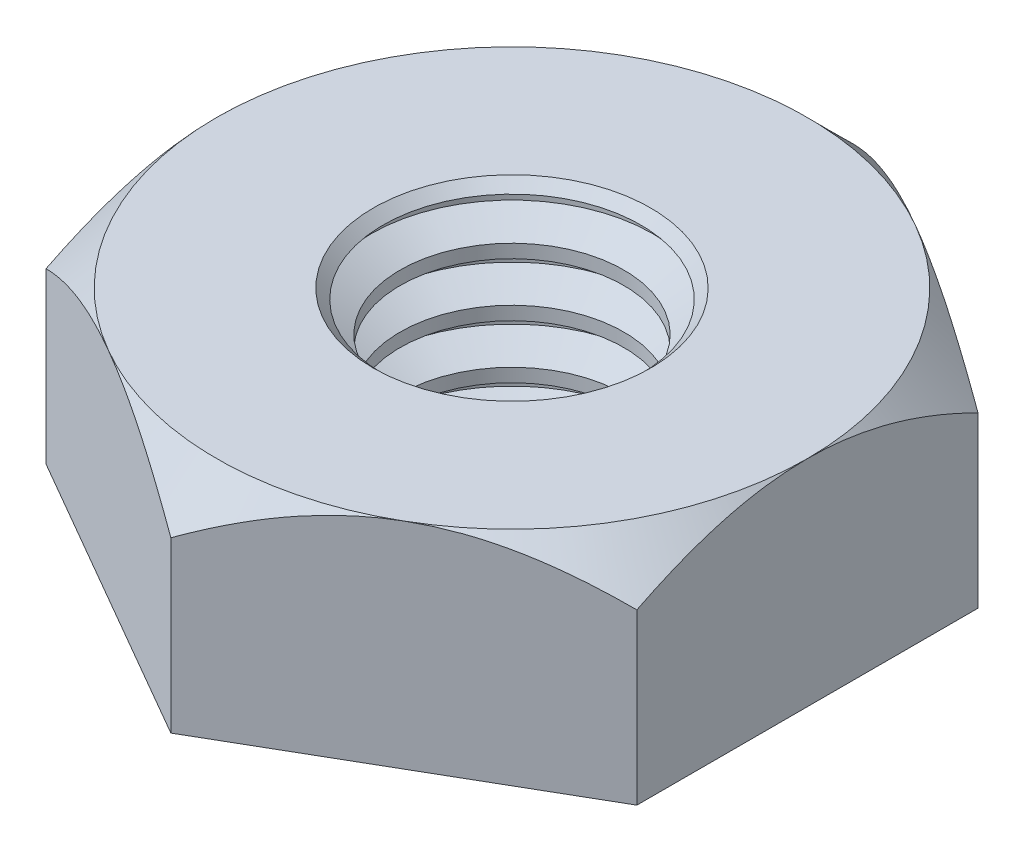
ISO-10303-21;
HEADER;
FILE_DESCRIPTION(('STEP AP214'),'2;1');
FILE_NAME('part.step','',(''),(''),'','','');
FILE_SCHEMA(('AUTOMOTIVE_DESIGN { 1 0 10303 214 1 1 1 1 }'));
ENDSEC;
DATA;
#1=APPLICATION_CONTEXT('core data for automotive mechanical design processes');
#2=APPLICATION_PROTOCOL_DEFINITION('international standard','automotive_design',2000,#1);
#3=PRODUCT_CONTEXT('',#1,'mechanical');
#4=PRODUCT('Part','Part','',(#3));
#5=PRODUCT_RELATED_PRODUCT_CATEGORY('part','',(#4));
#6=PRODUCT_DEFINITION_FORMATION('','',#4);
#7=PRODUCT_DEFINITION_CONTEXT('part definition',#1,'design');
#8=PRODUCT_DEFINITION('design','',#6,#7);
#9=PRODUCT_DEFINITION_SHAPE('','',#8);
#10=(LENGTH_UNIT() NAMED_UNIT(*) SI_UNIT(.MILLI.,.METRE.));
#11=(NAMED_UNIT(*) PLANE_ANGLE_UNIT() SI_UNIT($,.RADIAN.));
#12=(NAMED_UNIT(*) SI_UNIT($,.STERADIAN.) SOLID_ANGLE_UNIT());
#13=UNCERTAINTY_MEASURE_WITH_UNIT(LENGTH_MEASURE(1.E-05),#10,'distance_accuracy_value','');
#14=(GEOMETRIC_REPRESENTATION_CONTEXT(3) GLOBAL_UNCERTAINTY_ASSIGNED_CONTEXT((#13)) GLOBAL_UNIT_ASSIGNED_CONTEXT((#10,
#11,#12)) REPRESENTATION_CONTEXT('',''));
#15=CARTESIAN_POINT('',(0.,0.,0.));
#16=DIRECTION('',(0.,0.,1.));
#17=DIRECTION('',(1.,0.,0.));
#18=AXIS2_PLACEMENT_3D('',#15,#16,#17);
#19=CARTESIAN_POINT('',(0.,0.,-5.04098953786192));
#20=DIRECTION('',(0.,1.,0.));
#21=DIRECTION('',(0.,0.,1.));
#22=AXIS2_PLACEMENT_3D('',#19,#20,#21);
#23=PLANE('',#22);
#24=DIRECTION('',(-0.866025403784439,0.,-0.5));
#25=VECTOR('',#24,1.);
#26=CARTESIAN_POINT('',(4.365625,0.,-2.52049476893096));
#27=LINE('',#26,#25);
#28=CARTESIAN_POINT('',(4.365625,0.,-2.52049476893096));
#29=VERTEX_POINT('',#28);
#30=CARTESIAN_POINT('',(0.,0.,-5.04098953786192));
#31=VERTEX_POINT('',#30);
#32=EDGE_CURVE('E262',#29,#31,#27,.T.);
#33=ORIENTED_EDGE('',*,*,#32,.F.);
#34=DIRECTION('',(0.,0.,-1.));
#35=VECTOR('',#34,1.);
#36=CARTESIAN_POINT('',(4.365625,0.,2.52049476893096));
#37=LINE('',#36,#35);
#38=CARTESIAN_POINT('',(4.365625,0.,2.52049476893096));
#39=VERTEX_POINT('',#38);
#40=EDGE_CURVE('E269',#39,#29,#37,.T.);
#41=ORIENTED_EDGE('',*,*,#40,.F.);
#42=DIRECTION('',(0.866025403784439,0.,-0.5));
#43=VECTOR('',#42,1.);
#44=CARTESIAN_POINT('',(0.,0.,5.04098953786192));
#45=LINE('',#44,#43);
#46=CARTESIAN_POINT('',(0.,0.,5.04098953786192));
#47=VERTEX_POINT('',#46);
#48=EDGE_CURVE('E265',#47,#39,#45,.T.);
#49=ORIENTED_EDGE('',*,*,#48,.F.);
#50=DIRECTION('',(0.866025403784439,0.,0.5));
#51=VECTOR('',#50,1.);
#52=CARTESIAN_POINT('',(-4.365625,0.,2.52049476893096));
#53=LINE('',#52,#51);
#54=CARTESIAN_POINT('',(-4.365625,0.,2.52049476893096));
#55=VERTEX_POINT('',#54);
#56=EDGE_CURVE('E128',#55,#47,#53,.T.);
#57=ORIENTED_EDGE('',*,*,#56,.F.);
#58=DIRECTION('',(0.,0.,1.));
#59=VECTOR('',#58,1.);
#60=CARTESIAN_POINT('',(-4.365625,0.,-2.52049476893096));
#61=LINE('',#60,#59);
#62=CARTESIAN_POINT('',(-4.365625,0.,-2.52049476893096));
#63=VERTEX_POINT('',#62);
#64=EDGE_CURVE('E261',#63,#55,#61,.T.);
#65=ORIENTED_EDGE('',*,*,#64,.F.);
#66=DIRECTION('',(-0.866025403784439,0.,0.5));
#67=VECTOR('',#66,1.);
#68=CARTESIAN_POINT('',(0.,0.,-5.04098953786192));
#69=LINE('',#68,#67);
#70=EDGE_CURVE('E257',#31,#63,#69,.T.);
#71=ORIENTED_EDGE('',*,*,#70,.F.);
#72=EDGE_LOOP('',(#33,#41,#49,#57,#65,#71));
#73=FACE_BOUND('',#72,.T.);
#74=CARTESIAN_POINT('',(0.,0.,0.));
#75=DIRECTION('',(0.,1.,0.));
#76=DIRECTION('',(0.,0.,1.));
#77=AXIS2_PLACEMENT_3D('',#74,#75,#76);
#78=CIRCLE('',#77,1.65317020984131);
#79=CARTESIAN_POINT('',(0.,0.,1.65317020984131));
#80=VERTEX_POINT('',#79);
#81=EDGE_CURVE('E340',#80,#80,#78,.T.);
#82=ORIENTED_EDGE('',*,*,#81,.T.);
#83=EDGE_LOOP('',(#82));
#84=FACE_BOUND('',#83,.T.);
#85=ADVANCED_FACE('F35',(#73,#84),#23,.F.);
#86=CARTESIAN_POINT('',(0.,3.175,-5.04098953786192));
#87=DIRECTION('',(0.,1.,0.));
#88=DIRECTION('',(0.,0.,1.));
#89=AXIS2_PLACEMENT_3D('',#86,#87,#88);
#90=PLANE('',#89);
#91=CARTESIAN_POINT('',(0.,3.175,0.));
#92=DIRECTION('',(0.,1.,0.));
#93=DIRECTION('',(0.,0.,1.));
#94=AXIS2_PLACEMENT_3D('',#91,#92,#93);
#95=CIRCLE('',#94,2.05004520984131);
#96=CARTESIAN_POINT('',(0.,3.175,2.05004520984131));
#97=VERTEX_POINT('',#96);
#98=EDGE_CURVE('E12',#97,#97,#95,.F.);
#99=ORIENTED_EDGE('',*,*,#98,.T.);
#100=EDGE_LOOP('',(#99));
#101=FACE_BOUND('',#100,.T.);
#102=CARTESIAN_POINT('',(0.,3.175,0.));
#103=DIRECTION('',(0.,1.,0.));
#104=DIRECTION('',(0.,0.,1.));
#105=AXIS2_PLACEMENT_3D('',#102,#103,#104);
#106=CIRCLE('',#105,4.365625);
#107=CARTESIAN_POINT('',(-2.1828125,3.175,3.78074215339644));
#108=VERTEX_POINT('',#107);
#109=CARTESIAN_POINT('',(2.1828125,3.175,3.78074215339644));
#110=VERTEX_POINT('',#109);
#111=EDGE_CURVE('E110',#108,#110,#106,.T.);
#112=ORIENTED_EDGE('',*,*,#111,.T.);
#113=CARTESIAN_POINT('',(0.,3.175,0.));
#114=DIRECTION('',(0.,1.,0.));
#115=DIRECTION('',(0.,0.,1.));
#116=AXIS2_PLACEMENT_3D('',#113,#114,#115);
#117=CIRCLE('',#116,4.365625);
#118=CARTESIAN_POINT('',(4.365625,3.175,0.));
#119=VERTEX_POINT('',#118);
#120=EDGE_CURVE('E50',#110,#119,#117,.T.);
#121=ORIENTED_EDGE('',*,*,#120,.T.);
#122=CARTESIAN_POINT('',(2.1828125,3.175,-3.78074215339644));
#123=VERTEX_POINT('',#122);
#124=EDGE_CURVE('E143',#119,#123,#106,.T.);
#125=ORIENTED_EDGE('',*,*,#124,.T.);
#126=CARTESIAN_POINT('',(-2.1828125,3.175,-3.78074215339644));
#127=VERTEX_POINT('',#126);
#128=EDGE_CURVE('E147',#123,#127,#106,.T.);
#129=ORIENTED_EDGE('',*,*,#128,.T.);
#130=CARTESIAN_POINT('',(-4.365625,3.175,0.));
#131=VERTEX_POINT('',#130);
#132=EDGE_CURVE('E150',#127,#131,#106,.T.);
#133=ORIENTED_EDGE('',*,*,#132,.T.);
#134=EDGE_CURVE('E142',#131,#108,#106,.T.);
#135=ORIENTED_EDGE('',*,*,#134,.T.);
#136=EDGE_LOOP('',(#112,#121,#125,#129,#133,#135));
#137=FACE_BOUND('',#136,.T.);
#138=ADVANCED_FACE('F157',(#101,#137),#90,.T.);
#139=CARTESIAN_POINT('',(4.365625,3.175,-2.52049476893096));
#140=DIRECTION('',(-0.5,0.,0.866025403784439));
#141=DIRECTION('',(0.866025403784439,0.,0.5));
#142=AXIS2_PLACEMENT_3D('',#139,#140,#141);
#143=PLANE('',#142);
#144=CARTESIAN_POINT('',(4.365825,2.49951998811687,-2.52037929887713));
#145=CARTESIAN_POINT('',(4.29075926179721,2.5428556843937,-2.56371852303542));
#146=CARTESIAN_POINT('',(4.21511652405691,2.58486150694082,-2.60739087803202));
#147=CARTESIAN_POINT('',(4.06256384257887,2.66580884918542,-2.69546720974897));
#148=CARTESIAN_POINT('',(3.98565323405556,2.70474869521597,-2.73987157028344));
#149=CARTESIAN_POINT('',(3.75213521872552,2.81669452590529,-2.87469325929487));
#150=CARTESIAN_POINT('',(3.59355091897805,2.88434920314825,-2.96625194744332));
#151=CARTESIAN_POINT('',(3.27375295789606,3.00020333018922,-3.1508873863603));
#152=CARTESIAN_POINT('',(3.11262104210945,3.04869466909121,-3.24391694131474));
#153=CARTESIAN_POINT('',(2.86827398509099,3.1047873481826,-3.38499078046004));
#154=CARTESIAN_POINT('',(2.78646520845363,3.12070335091413,-3.43222309967369));
#155=CARTESIAN_POINT('',(2.62215493673047,3.14662706744581,-3.52708767928368));
#156=CARTESIAN_POINT('',(2.53965354705096,3.15663566431487,-3.57471987882366));
#157=CARTESIAN_POINT('',(2.33861197089847,3.17341632845891,-3.69079128693361));
#158=CARTESIAN_POINT('',(2.21985517581475,3.17693743451113,-3.7593555545433));
#159=CARTESIAN_POINT('',(1.9825555950651,3.17102881515628,-3.89636053136769));
#160=CARTESIAN_POINT('',(1.8640128990038,3.16159454983167,-3.96480118884914));
#161=CARTESIAN_POINT('',(1.62804507322986,3.13033130179081,-4.10103727657982));
#162=CARTESIAN_POINT('',(1.51062134300582,3.10848845674929,-4.16883189883392));
#163=CARTESIAN_POINT('',(1.27779209770266,3.05359557133502,-4.30325592628492));
#164=CARTESIAN_POINT('',(1.16238642859219,3.02054639026254,-4.36988542041185));
#165=CARTESIAN_POINT('',(0.957514998599648,2.95255207631629,-4.48816799566731));
#166=CARTESIAN_POINT('',(0.867595701157639,2.91939475932441,-4.5400829262508));
#167=CARTESIAN_POINT('',(0.689371364291638,2.84773661607479,-4.64298079511653));
#168=CARTESIAN_POINT('',(0.601066374030605,2.80923562738386,-4.69396370501452));
#169=CARTESIAN_POINT('',(0.42634877155884,2.72775327359755,-4.79483695983376));
#170=CARTESIAN_POINT('',(0.339931190163336,2.68478599766642,-4.84473017371517));
#171=CARTESIAN_POINT('',(0.168696346553443,2.59493525616829,-4.94359265676799));
#172=CARTESIAN_POINT('',(0.0838781412149917,2.54805419303698,-4.99256247045232));
#173=CARTESIAN_POINT('',(-0.000200000000001605,2.49951998811686,-5.04110500791576));
#174=B_SPLINE_CURVE_WITH_KNOTS('',3,(#144,#145,#146,#147,#148,#149,#150,#151,#152,#153,#154,
#155,#156,#157,#158,#159,#160,#161,#162,#163,#164,#165,#166,#167,#168,#169,#170,#171,#172,#173),
.UNSPECIFIED.,.F.,.F.,(4,2,2,2,2,2,2,2,2,2,2,2,2,2,4),(0.,0.290706610356815,0.581570828097977,
1.16643976138302,1.74202094661304,2.02924700568145,2.31643011786515,2.72731191561999,
3.13833773437735,3.54982363883689,3.96127799774813,4.28811145534738,4.61495484997813,
4.94079680753749,5.26644020086356),.UNSPECIFIED.);
#175=CARTESIAN_POINT('',(4.365625,2.49963546213808,-2.52049476893097));
#176=VERTEX_POINT('',#175);
#177=EDGE_CURVE('E272',#176,#123,#174,.T.);
#178=ORIENTED_EDGE('',*,*,#177,.F.);
#179=DIRECTION('',(0.,-1.,0.));
#180=VECTOR('',#179,1.);
#181=CARTESIAN_POINT('',(4.365625,3.175,-2.52049476893096));
#182=LINE('',#181,#180);
#183=EDGE_CURVE('E135',#176,#29,#182,.T.);
#184=ORIENTED_EDGE('',*,*,#183,.T.);
#185=ORIENTED_EDGE('',*,*,#32,.T.);
#186=DIRECTION('',(0.,-1.,0.));
#187=VECTOR('',#186,1.);
#188=CARTESIAN_POINT('',(0.,3.175,-5.04098953786192));
#189=LINE('',#188,#187);
#190=CARTESIAN_POINT('',(0.,2.49963546213808,-5.04098953786192));
#191=VERTEX_POINT('',#190);
#192=EDGE_CURVE('E140',#191,#31,#189,.T.);
#193=ORIENTED_EDGE('',*,*,#192,.F.);
#194=EDGE_CURVE('E209',#123,#191,#174,.T.);
#195=ORIENTED_EDGE('',*,*,#194,.F.);
#196=EDGE_LOOP('',(#178,#184,#185,#193,#195));
#197=FACE_BOUND('',#196,.T.);
#198=ADVANCED_FACE('F218',(#197),#143,.F.);
#199=CARTESIAN_POINT('',(0.,3.175,-5.04098953786192));
#200=DIRECTION('',(0.5,0.,0.866025403784439));
#201=DIRECTION('',(0.866025403784439,0.,-0.5));
#202=AXIS2_PLACEMENT_3D('',#199,#200,#201);
#203=PLANE('',#202);
#204=CARTESIAN_POINT('',(0.000199999999998374,2.49951998811686,-5.04110500791576));
#205=CARTESIAN_POINT('',(-0.0748657382027902,2.54285568439369,-4.99776578375746));
#206=CARTESIAN_POINT('',(-0.150508475943085,2.58486150694081,-4.95409342876086));
#207=CARTESIAN_POINT('',(-0.30306115742113,2.66580884918542,-4.86601709704392));
#208=CARTESIAN_POINT('',(-0.379971765944441,2.70474869521597,-4.82161273650944));
#209=CARTESIAN_POINT('',(-0.613489781274479,2.81669452590529,-4.68679104749802));
#210=CARTESIAN_POINT('',(-0.772074081021948,2.88434920314825,-4.59523235934957));
#211=CARTESIAN_POINT('',(-1.09187204210394,3.00020333018922,-4.41059692043259));
#212=CARTESIAN_POINT('',(-1.25300395789055,3.0486946690912,-4.31756736547815));
#213=CARTESIAN_POINT('',(-1.49735101490901,3.1047873481826,-4.17649352633285));
#214=CARTESIAN_POINT('',(-1.57915979154637,3.12070335091412,-4.1292612071192));
#215=CARTESIAN_POINT('',(-1.74347006326953,3.14662706744581,-4.03439662750921));
#216=CARTESIAN_POINT('',(-1.82597145294904,3.15663566431487,-3.98676442796922));
#217=CARTESIAN_POINT('',(-2.02701302910153,3.17341632845891,-3.87069301985927));
#218=CARTESIAN_POINT('',(-2.14576982418526,3.17693743451113,-3.80212875224959));
#219=CARTESIAN_POINT('',(-2.3830694049349,3.17102881515628,-3.6651237754252));
#220=CARTESIAN_POINT('',(-2.5016121009962,3.16159454983167,-3.59668311794374));
#221=CARTESIAN_POINT('',(-2.73757992677014,3.13033130179081,-3.46044703021306));
#222=CARTESIAN_POINT('',(-2.85500365699418,3.10848845674929,-3.39265240795897));
#223=CARTESIAN_POINT('',(-3.08783290229734,3.05359557133502,-3.25822838050797));
#224=CARTESIAN_POINT('',(-3.20323857140781,3.02054639026254,-3.19159888638103));
#225=CARTESIAN_POINT('',(-3.40811000140035,2.95255207631629,-3.07331631112557));
#226=CARTESIAN_POINT('',(-3.49802929884236,2.91939475932441,-3.02140138054209));
#227=CARTESIAN_POINT('',(-3.67625363570836,2.84773661607479,-2.91850351167636));
#228=CARTESIAN_POINT('',(-3.7645586259694,2.80923562738386,-2.86752060177837));
#229=CARTESIAN_POINT('',(-3.93927622844116,2.72775327359755,-2.76664734695913));
#230=CARTESIAN_POINT('',(-4.02569380983666,2.68478599766642,-2.71675413307772));
#231=CARTESIAN_POINT('',(-4.19692865344656,2.59493525616829,-2.6178916500249));
#232=CARTESIAN_POINT('',(-4.28174685878501,2.54805419303698,-2.56892183634056));
#233=CARTESIAN_POINT('',(-4.365825,2.49951998811686,-2.52037929887712));
#234=B_SPLINE_CURVE_WITH_KNOTS('',3,(#204,#205,#206,#207,#208,#209,#210,#211,#212,#213,#214,
#215,#216,#217,#218,#219,#220,#221,#222,#223,#224,#225,#226,#227,#228,#229,#230,#231,#232,#233),
.UNSPECIFIED.,.F.,.F.,(4,2,2,2,2,2,2,2,2,2,2,2,2,2,4),(0.,0.290706610356816,0.581570828097979,
1.16643976138302,1.74202094661305,2.02924700568145,2.31643011786515,2.72731191561999,
3.13833773437736,3.54982363883689,3.96127799774814,4.28811145534738,4.61495484997813,
4.94079680753749,5.26644020086356),.UNSPECIFIED.);
#235=EDGE_CURVE('E208',#191,#127,#234,.T.);
#236=ORIENTED_EDGE('',*,*,#235,.F.);
#237=ORIENTED_EDGE('',*,*,#192,.T.);
#238=ORIENTED_EDGE('',*,*,#70,.T.);
#239=DIRECTION('',(0.,-1.,0.));
#240=VECTOR('',#239,1.);
#241=CARTESIAN_POINT('',(-4.365625,3.175,-2.52049476893096));
#242=LINE('',#241,#240);
#243=CARTESIAN_POINT('',(-4.365625,2.49963546213808,-2.52049476893097));
#244=VERTEX_POINT('',#243);
#245=EDGE_CURVE('E133',#244,#63,#242,.T.);
#246=ORIENTED_EDGE('',*,*,#245,.F.);
#247=EDGE_CURVE('E203',#127,#244,#234,.T.);
#248=ORIENTED_EDGE('',*,*,#247,.F.);
#249=EDGE_LOOP('',(#236,#237,#238,#246,#248));
#250=FACE_BOUND('',#249,.T.);
#251=ADVANCED_FACE('F214',(#250),#203,.F.);
#252=CARTESIAN_POINT('',(-4.365625,3.175,-2.52049476893096));
#253=DIRECTION('',(1.,0.,0.));
#254=DIRECTION('',(0.,0.,-1.));
#255=AXIS2_PLACEMENT_3D('',#252,#253,#254);
#256=PLANE('',#255);
#257=CARTESIAN_POINT('',(-4.365625,0.704912579661346,-5.26006489056433));
#258=CARTESIAN_POINT('',(-4.365625,0.80267892983793,-5.1329841859818));
#259=CARTESIAN_POINT('',(-4.365625,0.899569220714148,-5.00521874689069));
#260=CARTESIAN_POINT('',(-4.365625,1.09119744425269,-4.7480385262146));
#261=CARTESIAN_POINT('',(-4.365625,1.18593486227081,-4.6186233615674));
#262=CARTESIAN_POINT('',(-4.365625,1.37353129405869,-4.35691808766542));
#263=CARTESIAN_POINT('',(-4.365625,1.46637017769497,-4.22461350133101));
#264=CARTESIAN_POINT('',(-4.365625,1.64881712700763,-3.95780239294876));
#265=CARTESIAN_POINT('',(-4.365625,1.73842541514534,-3.82329602344843));
#266=CARTESIAN_POINT('',(-4.365625,1.91923152416555,-3.54310038592311));
#267=CARTESIAN_POINT('',(-4.365625,2.0101698538518,-3.39724282764264));
#268=CARTESIAN_POINT('',(-4.365625,2.18640211336186,-3.10210247150436));
#269=CARTESIAN_POINT('',(-4.365625,2.27169509328475,-2.95281910287325));
#270=CARTESIAN_POINT('',(-4.365625,2.43482022055583,-2.65078628816501));
#271=CARTESIAN_POINT('',(-4.365625,2.51267426921964,-2.49804876401671));
#272=CARTESIAN_POINT('',(-4.365625,2.65917723070185,-2.18825597231203));
#273=CARTESIAN_POINT('',(-4.365625,2.72783048599296,-2.03120278408456));
#274=CARTESIAN_POINT('',(-4.365625,2.84724495878238,-1.72816423864564));
#275=CARTESIAN_POINT('',(-4.365625,2.89910313311,-1.5826155847136));
#276=CARTESIAN_POINT('',(-4.365625,2.99116920619303,-1.2878101350948));
#277=CARTESIAN_POINT('',(-4.365625,3.03137636289258,-1.1385531038777));
#278=CARTESIAN_POINT('',(-4.365625,3.09729383406965,-0.83982185436757));
#279=CARTESIAN_POINT('',(-4.365625,3.12326744800821,-0.690406728134636));
#280=CARTESIAN_POINT('',(-4.365625,3.16017597579481,-0.389720117691568));
#281=CARTESIAN_POINT('',(-4.365625,3.17111400974627,-0.238449025197239));
#282=CARTESIAN_POINT('',(-4.365625,3.1770196548063,0.0577907271338069));
#283=CARTESIAN_POINT('',(-4.365625,3.17266407223423,0.202746020460245));
#284=CARTESIAN_POINT('',(-4.365625,3.14977668074263,0.491525443469046));
#285=CARTESIAN_POINT('',(-4.365625,3.13124358417651,0.635349469207359));
#286=CARTESIAN_POINT('',(-4.365625,3.08073406930188,0.923262931460914));
#287=CARTESIAN_POINT('',(-4.365625,3.04852030695866,1.0673100183025));
#288=CARTESIAN_POINT('',(-4.365625,2.97243663849279,1.35223202145247));
#289=CARTESIAN_POINT('',(-4.365625,2.92856739438755,1.49310711743332));
#290=CARTESIAN_POINT('',(-4.365625,2.82829132796462,1.77944606428932));
#291=CARTESIAN_POINT('',(-4.365625,2.77130692063028,1.92470532838635));
#292=CARTESIAN_POINT('',(-4.365625,2.64853439221219,2.21148751875443));
#293=CARTESIAN_POINT('',(-4.365625,2.58274230151922,2.35300872565198));
#294=CARTESIAN_POINT('',(-4.365625,2.44391465170222,2.63298314411336));
#295=CARTESIAN_POINT('',(-4.365625,2.37085678258171,2.77142520257403));
#296=CARTESIAN_POINT('',(-4.365625,2.219105296034,3.04513698555421));
#297=CARTESIAN_POINT('',(-4.365625,2.14041254634271,3.18040719427782));
#298=CARTESIAN_POINT('',(-4.365625,1.98248926861825,3.44157865405833));
#299=CARTESIAN_POINT('',(-4.365625,1.9034771910414,3.56761269781683));
#300=CARTESIAN_POINT('',(-4.365625,1.74208988391647,3.81751542571875));
#301=CARTESIAN_POINT('',(-4.365625,1.65971440221839,3.9413839465179));
#302=CARTESIAN_POINT('',(-4.365625,1.4928706732036,4.18624305036429));
#303=CARTESIAN_POINT('',(-4.365625,1.40842453863359,4.30724875510755));
#304=CARTESIAN_POINT('',(-4.365625,1.23726856590243,4.54760013073487));
#305=CARTESIAN_POINT('',(-4.365625,1.1505593581824,4.66694625003688));
#306=CARTESIAN_POINT('',(-4.365625,1.06292381609541,4.78559619977847));
#307=B_SPLINE_CURVE_WITH_KNOTS('',3,(#257,#258,#259,#260,#261,#262,#263,#264,#265,#266,#267,
#268,#269,#270,#271,#272,#273,#274,#275,#276,#277,#278,#279,#280,#281,#282,#283,#284,#285,#286,
#287,#288,#289,#290,#291,#292,#293,#294,#295,#296,#297,#298,#299,#300,#301,#302,#303,#304,#305,
#306),.UNSPECIFIED.,.F.,.F.,(4,2,2,2,2,2,2,2,2,2,2,2,2,2,2,2,2,2,2,2,2,2,2,2,4),(0.,
0.481018057807076,0.962149918440635,1.44699361883673,1.93180386850032,2.44735513975326,
2.96299293959461,3.47706255965263,3.99088869478828,4.4540225010778,4.91718579798021,
5.37146415229228,5.82564822294318,6.25999088997209,6.69437301005721,7.13662055973024,
7.57884299564045,8.04659469469021,8.51455792293897,8.98400523488901,9.45338040975317,
9.89957717259381,10.3458074478608,10.7884549913015,11.2309805122862),.UNSPECIFIED.);
#308=EDGE_CURVE('E162',#244,#131,#307,.T.);
#309=ORIENTED_EDGE('',*,*,#308,.F.);
#310=ORIENTED_EDGE('',*,*,#245,.T.);
#311=ORIENTED_EDGE('',*,*,#64,.T.);
#312=DIRECTION('',(0.,-1.,0.));
#313=VECTOR('',#312,1.);
#314=CARTESIAN_POINT('',(-4.365625,3.175,2.52049476893096));
#315=LINE('',#314,#313);
#316=CARTESIAN_POINT('',(-4.36562500000001,2.49963546213808,2.52049476893096));
#317=VERTEX_POINT('',#316);
#318=EDGE_CURVE('E130',#317,#55,#315,.T.);
#319=ORIENTED_EDGE('',*,*,#318,.F.);
#320=EDGE_CURVE('E160',#131,#317,#307,.T.);
#321=ORIENTED_EDGE('',*,*,#320,.F.);
#322=EDGE_LOOP('',(#309,#310,#311,#319,#321));
#323=FACE_BOUND('',#322,.T.);
#324=ADVANCED_FACE('F217',(#323),#256,.F.);
#325=CARTESIAN_POINT('',(-4.365625,3.175,2.52049476893096));
#326=DIRECTION('',(0.5,0.,-0.866025403784439));
#327=DIRECTION('',(-0.866025403784439,0.,-0.5));
#328=AXIS2_PLACEMENT_3D('',#325,#326,#327);
#329=PLANE('',#328);
#330=CARTESIAN_POINT('',(-4.365825,2.49951998811686,2.52037929887712));
#331=CARTESIAN_POINT('',(-4.29075926179721,2.5428556843937,2.56371852303542));
#332=CARTESIAN_POINT('',(-4.21511652405692,2.58486150694082,2.60739087803202));
#333=CARTESIAN_POINT('',(-4.06256384257887,2.66580884918542,2.69546720974897));
#334=CARTESIAN_POINT('',(-3.98565323405556,2.70474869521597,2.73987157028344));
#335=CARTESIAN_POINT('',(-3.75213521872552,2.81669452590529,2.87469325929486));
#336=CARTESIAN_POINT('',(-3.59355091897806,2.88434920314825,2.96625194744331));
#337=CARTESIAN_POINT('',(-3.27375295789606,3.00020333018922,3.1508873863603));
#338=CARTESIAN_POINT('',(-3.11262104210946,3.04869466909121,3.24391694131473));
#339=CARTESIAN_POINT('',(-2.86827398509099,3.1047873481826,3.38499078046004));
#340=CARTESIAN_POINT('',(-2.78646520845364,3.12070335091413,3.43222309967369));
#341=CARTESIAN_POINT('',(-2.62215493673047,3.14662706744582,3.52708767928368));
#342=CARTESIAN_POINT('',(-2.53965354705096,3.15663566431487,3.57471987882366));
#343=CARTESIAN_POINT('',(-2.33861197089847,3.17341632845892,3.69079128693361));
#344=CARTESIAN_POINT('',(-2.21985517581475,3.17693743451114,3.75935555454329));
#345=CARTESIAN_POINT('',(-1.98255559506511,3.17102881515629,3.89636053136768));
#346=CARTESIAN_POINT('',(-1.8640128990038,3.16159454983167,3.96480118884914));
#347=CARTESIAN_POINT('',(-1.62804507322986,3.13033130179081,4.10103727657982));
#348=CARTESIAN_POINT('',(-1.51062134300582,3.10848845674929,4.16883189883391));
#349=CARTESIAN_POINT('',(-1.27779209770266,3.05359557133503,4.30325592628491));
#350=CARTESIAN_POINT('',(-1.16238642859219,3.02054639026254,4.36988542041185));
#351=CARTESIAN_POINT('',(-0.957514998599652,2.9525520763163,4.48816799566731));
#352=CARTESIAN_POINT('',(-0.867595701157642,2.91939475932441,4.54008292625079));
#353=CARTESIAN_POINT('',(-0.689371364291641,2.8477366160748,4.64298079511652));
#354=CARTESIAN_POINT('',(-0.601066374030608,2.80923562738387,4.69396370501451));
#355=CARTESIAN_POINT('',(-0.426348771558844,2.72775327359756,4.79483695983375));
#356=CARTESIAN_POINT('',(-0.339931190163339,2.68478599766643,4.84473017371517));
#357=CARTESIAN_POINT('',(-0.168696346553447,2.5949352561683,4.94359265676798));
#358=CARTESIAN_POINT('',(-0.0838781412149956,2.54805419303699,4.99256247045232));
#359=CARTESIAN_POINT('',(0.000199999999997297,2.49951998811687,5.04110500791575));
#360=B_SPLINE_CURVE_WITH_KNOTS('',3,(#330,#331,#332,#333,#334,#335,#336,#337,#338,#339,#340,
#341,#342,#343,#344,#345,#346,#347,#348,#349,#350,#351,#352,#353,#354,#355,#356,#357,#358,#359),
.UNSPECIFIED.,.F.,.F.,(4,2,2,2,2,2,2,2,2,2,2,2,2,2,4),(0.,0.290706610356816,0.581570828097978,
1.16643976138302,1.74202094661304,2.02924700568145,2.31643011786515,2.72731191561999,
3.13833773437736,3.54982363883689,3.96127799774813,4.28811145534738,4.61495484997813,
4.94079680753749,5.26644020086355),.UNSPECIFIED.);
#361=EDGE_CURVE('E115',#317,#108,#360,.T.);
#362=ORIENTED_EDGE('',*,*,#361,.F.);
#363=ORIENTED_EDGE('',*,*,#318,.T.);
#364=ORIENTED_EDGE('',*,*,#56,.T.);
#365=DIRECTION('',(0.,-1.,0.));
#366=VECTOR('',#365,1.);
#367=CARTESIAN_POINT('',(0.,3.175,5.04098953786192));
#368=LINE('',#367,#366);
#369=CARTESIAN_POINT('',(0.,2.49963546213808,5.04098953786192));
#370=VERTEX_POINT('',#369);
#371=EDGE_CURVE('E121',#370,#47,#368,.T.);
#372=ORIENTED_EDGE('',*,*,#371,.F.);
#373=EDGE_CURVE('E106',#108,#370,#360,.T.);
#374=ORIENTED_EDGE('',*,*,#373,.F.);
#375=EDGE_LOOP('',(#362,#363,#364,#372,#374));
#376=FACE_BOUND('',#375,.T.);
#377=ADVANCED_FACE('F126',(#376),#329,.F.);
#378=CARTESIAN_POINT('',(0.,3.175,5.04098953786192));
#379=DIRECTION('',(-0.5,0.,-0.866025403784439));
#380=DIRECTION('',(-0.866025403784439,0.,0.5));
#381=AXIS2_PLACEMENT_3D('',#378,#379,#380);
#382=PLANE('',#381);
#383=CARTESIAN_POINT('',(-0.00020000000000279,2.49951998811687,5.04110500791576));
#384=CARTESIAN_POINT('',(0.0748657382027853,2.5428556843937,4.99776578375746));
#385=CARTESIAN_POINT('',(0.15050847594308,2.58486150694082,4.95409342876086));
#386=CARTESIAN_POINT('',(0.303061157421125,2.66580884918542,4.86601709704391));
#387=CARTESIAN_POINT('',(0.379971765944435,2.70474869521597,4.82161273650944));
#388=CARTESIAN_POINT('',(0.613489781274473,2.8166945259053,4.68679104749801));
#389=CARTESIAN_POINT('',(0.772074081021943,2.88434920314826,4.59523235934957));
#390=CARTESIAN_POINT('',(1.09187204210394,3.00020333018922,4.41059692043258));
#391=CARTESIAN_POINT('',(1.25300395789054,3.04869466909121,4.31756736547815));
#392=CARTESIAN_POINT('',(1.49735101490901,3.1047873481826,4.17649352633284));
#393=CARTESIAN_POINT('',(1.57915979154636,3.12070335091413,4.12926120711919));
#394=CARTESIAN_POINT('',(1.74347006326953,3.14662706744582,4.0343966275092));
#395=CARTESIAN_POINT('',(1.82597145294903,3.15663566431487,3.98676442796922));
#396=CARTESIAN_POINT('',(2.02701302910153,3.17341632845892,3.87069301985927));
#397=CARTESIAN_POINT('',(2.14576982418525,3.17693743451114,3.80212875224959));
#398=CARTESIAN_POINT('',(2.38306940493489,3.17102881515629,3.6651237754252));
#399=CARTESIAN_POINT('',(2.5016121009962,3.16159454983167,3.59668311794374));
#400=CARTESIAN_POINT('',(2.73757992677014,3.13033130179081,3.46044703021306));
#401=CARTESIAN_POINT('',(2.85500365699418,3.10848845674929,3.39265240795896));
#402=CARTESIAN_POINT('',(3.08783290229733,3.05359557133503,3.25822838050797));
#403=CARTESIAN_POINT('',(3.20323857140781,3.02054639026254,3.19159888638103));
#404=CARTESIAN_POINT('',(3.40811000140035,2.9525520763163,3.07331631112557));
#405=CARTESIAN_POINT('',(3.49802929884236,2.91939475932441,3.02140138054209));
#406=CARTESIAN_POINT('',(3.67625363570836,2.8477366160748,2.91850351167636));
#407=CARTESIAN_POINT('',(3.76455862596939,2.80923562738387,2.86752060177836));
#408=CARTESIAN_POINT('',(3.93927622844116,2.72775327359755,2.76664734695912));
#409=CARTESIAN_POINT('',(4.02569380983666,2.68478599766643,2.71675413307771));
#410=CARTESIAN_POINT('',(4.19692865344655,2.5949352561683,2.6178916500249));
#411=CARTESIAN_POINT('',(4.281746858785,2.54805419303699,2.56892183634056));
#412=CARTESIAN_POINT('',(4.365825,2.49951998811687,2.52037929887712));
#413=B_SPLINE_CURVE_WITH_KNOTS('',3,(#383,#384,#385,#386,#387,#388,#389,#390,#391,#392,#393,
#394,#395,#396,#397,#398,#399,#400,#401,#402,#403,#404,#405,#406,#407,#408,#409,#410,#411,#412),
.UNSPECIFIED.,.F.,.F.,(4,2,2,2,2,2,2,2,2,2,2,2,2,2,4),(0.,0.290706610356815,0.581570828097978,
1.16643976138302,1.74202094661304,2.02924700568145,2.31643011786515,2.72731191561999,
3.13833773437735,3.54982363883689,3.96127799774813,4.28811145534738,4.61495484997813,
4.94079680753749,5.26644020086356),.UNSPECIFIED.);
#414=EDGE_CURVE('E109',#370,#110,#413,.T.);
#415=ORIENTED_EDGE('',*,*,#414,.F.);
#416=ORIENTED_EDGE('',*,*,#371,.T.);
#417=ORIENTED_EDGE('',*,*,#48,.T.);
#418=DIRECTION('',(0.,-1.,0.));
#419=VECTOR('',#418,1.);
#420=CARTESIAN_POINT('',(4.365625,3.175,2.52049476893096));
#421=LINE('',#420,#419);
#422=CARTESIAN_POINT('',(4.365625,2.49963546213808,2.52049476893097));
#423=VERTEX_POINT('',#422);
#424=EDGE_CURVE('E131',#423,#39,#421,.T.);
#425=ORIENTED_EDGE('',*,*,#424,.F.);
#426=EDGE_CURVE('E124',#110,#423,#413,.T.);
#427=ORIENTED_EDGE('',*,*,#426,.F.);
#428=EDGE_LOOP('',(#415,#416,#417,#425,#427));
#429=FACE_BOUND('',#428,.T.);
#430=ADVANCED_FACE('F119',(#429),#382,.F.);
#431=CARTESIAN_POINT('',(4.365625,3.175,2.52049476893096));
#432=DIRECTION('',(-1.,0.,0.));
#433=DIRECTION('',(0.,0.,1.));
#434=AXIS2_PLACEMENT_3D('',#431,#432,#433);
#435=PLANE('',#434);
#436=CARTESIAN_POINT('',(4.365625,0.704912579661347,-5.26006489056433));
#437=CARTESIAN_POINT('',(4.365625,0.802678929837931,-5.1329841859818));
#438=CARTESIAN_POINT('',(4.365625,0.899569220714149,-5.0052187468907));
#439=CARTESIAN_POINT('',(4.365625,1.09119744425269,-4.7480385262146));
#440=CARTESIAN_POINT('',(4.365625,1.18593486227081,-4.6186233615674));
#441=CARTESIAN_POINT('',(4.365625,1.3735312940587,-4.35691808766542));
#442=CARTESIAN_POINT('',(4.365625,1.46637017769497,-4.22461350133101));
#443=CARTESIAN_POINT('',(4.365625,1.64881712700764,-3.95780239294876));
#444=CARTESIAN_POINT('',(4.365625,1.73842541514534,-3.82329602344843));
#445=CARTESIAN_POINT('',(4.365625,1.91923152416555,-3.54310038592311));
#446=CARTESIAN_POINT('',(4.365625,2.0101698538518,-3.39724282764265));
#447=CARTESIAN_POINT('',(4.365625,2.18640211336186,-3.10210247150436));
#448=CARTESIAN_POINT('',(4.365625,2.27169509328475,-2.95281910287325));
#449=CARTESIAN_POINT('',(4.365625,2.43482022055583,-2.65078628816501));
#450=CARTESIAN_POINT('',(4.365625,2.51267426921964,-2.49804876401671));
#451=CARTESIAN_POINT('',(4.365625,2.65917723070185,-2.18825597231203));
#452=CARTESIAN_POINT('',(4.365625,2.72783048599296,-2.03120278408456));
#453=CARTESIAN_POINT('',(4.365625,2.84724495878238,-1.72816423864564));
#454=CARTESIAN_POINT('',(4.365625,2.89910313311001,-1.58261558471361));
#455=CARTESIAN_POINT('',(4.365625,2.99116920619303,-1.2878101350948));
#456=CARTESIAN_POINT('',(4.365625,3.03137636289259,-1.1385531038777));
#457=CARTESIAN_POINT('',(4.365625,3.09729383406965,-0.839821854367571));
#458=CARTESIAN_POINT('',(4.365625,3.12326744800821,-0.690406728134637));
#459=CARTESIAN_POINT('',(4.365625,3.16017597579481,-0.389720117691569));
#460=CARTESIAN_POINT('',(4.365625,3.17111400974628,-0.23844902519724));
#461=CARTESIAN_POINT('',(4.365625,3.1770196548063,0.0577907271338055));
#462=CARTESIAN_POINT('',(4.365625,3.17266407223424,0.202746020460243));
#463=CARTESIAN_POINT('',(4.365625,3.14977668074263,0.491525443469045));
#464=CARTESIAN_POINT('',(4.365625,3.13124358417652,0.635349469207358));
#465=CARTESIAN_POINT('',(4.365625,3.08073406930189,0.923262931460913));
#466=CARTESIAN_POINT('',(4.365625,3.04852030695866,1.0673100183025));
#467=CARTESIAN_POINT('',(4.365625,2.97243663849279,1.35223202145247));
#468=CARTESIAN_POINT('',(4.365625,2.92856739438756,1.49310711743332));
#469=CARTESIAN_POINT('',(4.365625,2.82829132796462,1.77944606428932));
#470=CARTESIAN_POINT('',(4.365625,2.77130692063029,1.92470532838634));
#471=CARTESIAN_POINT('',(4.365625,2.64853439221219,2.21148751875443));
#472=CARTESIAN_POINT('',(4.365625,2.58274230151922,2.35300872565198));
#473=CARTESIAN_POINT('',(4.365625,2.44391465170222,2.63298314411336));
#474=CARTESIAN_POINT('',(4.365625,2.37085678258172,2.77142520257403));
#475=CARTESIAN_POINT('',(4.365625,2.219105296034,3.04513698555421));
#476=CARTESIAN_POINT('',(4.365625,2.14041254634271,3.18040719427782));
#477=CARTESIAN_POINT('',(4.365625,1.98248926861825,3.44157865405832));
#478=CARTESIAN_POINT('',(4.365625,1.90347719104141,3.56761269781683));
#479=CARTESIAN_POINT('',(4.365625,1.74208988391648,3.81751542571875));
#480=CARTESIAN_POINT('',(4.365625,1.6597144022184,3.9413839465179));
#481=CARTESIAN_POINT('',(4.365625,1.49287067320361,4.18624305036429));
#482=CARTESIAN_POINT('',(4.365625,1.4084245386336,4.30724875510754));
#483=CARTESIAN_POINT('',(4.365625,1.23726856590244,4.54760013073487));
#484=CARTESIAN_POINT('',(4.365625,1.1505593581824,4.66694625003688));
#485=CARTESIAN_POINT('',(4.365625,1.06292381609542,4.78559619977847));
#486=B_SPLINE_CURVE_WITH_KNOTS('',3,(#436,#437,#438,#439,#440,#441,#442,#443,#444,#445,#446,
#447,#448,#449,#450,#451,#452,#453,#454,#455,#456,#457,#458,#459,#460,#461,#462,#463,#464,#465,
#466,#467,#468,#469,#470,#471,#472,#473,#474,#475,#476,#477,#478,#479,#480,#481,#482,#483,#484,
#485),.UNSPECIFIED.,.F.,.F.,(4,2,2,2,2,2,2,2,2,2,2,2,2,2,2,2,2,2,2,2,2,2,2,2,4),(0.,
0.481018057807077,0.962149918440637,1.44699361883673,1.93180386850032,2.44735513975326,
2.96299293959462,3.47706255965263,3.99088869478828,4.4540225010778,4.91718579798021,
5.37146415229229,5.82564822294318,6.25999088997209,6.69437301005722,7.13662055973025,
7.57884299564045,8.04659469469021,8.51455792293897,8.98400523488901,9.45338040975317,
9.89957717259381,10.3458074478608,10.7884549913015,11.2309805122862),.UNSPECIFIED.);
#487=EDGE_CURVE('E293',#423,#119,#486,.F.);
#488=ORIENTED_EDGE('',*,*,#487,.F.);
#489=ORIENTED_EDGE('',*,*,#424,.T.);
#490=ORIENTED_EDGE('',*,*,#40,.T.);
#491=ORIENTED_EDGE('',*,*,#183,.F.);
#492=EDGE_CURVE('E193',#119,#176,#486,.F.);
#493=ORIENTED_EDGE('',*,*,#492,.F.);
#494=EDGE_LOOP('',(#488,#489,#490,#491,#493));
#495=FACE_BOUND('',#494,.T.);
#496=ADVANCED_FACE('F235',(#495),#435,.F.);
#497=CARTESIAN_POINT('',(0.,3.175,0.));
#498=DIRECTION('',(0.,-1.,0.));
#499=DIRECTION('',(0.,0.,-1.));
#500=AXIS2_PLACEMENT_3D('',#497,#498,#499);
#501=CONICAL_SURFACE('',#500,4.365625,0.785398163397454);
#502=ORIENTED_EDGE('',*,*,#373,.T.);
#503=ORIENTED_EDGE('',*,*,#414,.T.);
#504=ORIENTED_EDGE('',*,*,#111,.F.);
#505=EDGE_LOOP('',(#502,#503,#504));
#506=FACE_BOUND('',#505,.T.);
#507=ADVANCED_FACE('F108',(#506),#501,.T.);
#508=ORIENTED_EDGE('',*,*,#320,.T.);
#509=ORIENTED_EDGE('',*,*,#361,.T.);
#510=ORIENTED_EDGE('',*,*,#134,.F.);
#511=EDGE_LOOP('',(#508,#509,#510));
#512=FACE_BOUND('',#511,.T.);
#513=ADVANCED_FACE('F159',(#512),#501,.T.);
#514=ORIENTED_EDGE('',*,*,#247,.T.);
#515=ORIENTED_EDGE('',*,*,#308,.T.);
#516=ORIENTED_EDGE('',*,*,#132,.F.);
#517=EDGE_LOOP('',(#514,#515,#516));
#518=FACE_BOUND('',#517,.T.);
#519=ADVANCED_FACE('F277',(#518),#501,.T.);
#520=ORIENTED_EDGE('',*,*,#194,.T.);
#521=ORIENTED_EDGE('',*,*,#235,.T.);
#522=ORIENTED_EDGE('',*,*,#128,.F.);
#523=EDGE_LOOP('',(#520,#521,#522));
#524=FACE_BOUND('',#523,.T.);
#525=ADVANCED_FACE('F186',(#524),#501,.T.);
#526=ORIENTED_EDGE('',*,*,#177,.T.);
#527=ORIENTED_EDGE('',*,*,#124,.F.);
#528=ORIENTED_EDGE('',*,*,#492,.T.);
#529=EDGE_LOOP('',(#526,#527,#528));
#530=FACE_BOUND('',#529,.T.);
#531=ADVANCED_FACE('F180',(#530),#501,.T.);
#532=ORIENTED_EDGE('',*,*,#426,.T.);
#533=ORIENTED_EDGE('',*,*,#487,.T.);
#534=ORIENTED_EDGE('',*,*,#120,.F.);
#535=EDGE_LOOP('',(#532,#533,#534));
#536=FACE_BOUND('',#535,.T.);
#537=ADVANCED_FACE('F185',(#536),#501,.T.);
#538=CARTESIAN_POINT('',(0.,2.926953125,0.));
#539=DIRECTION('',(0.,-1.,0.));
#540=DIRECTION('',(0.,0.,-1.));
#541=AXIS2_PLACEMENT_3D('',#538,#539,#540);
#542=CONICAL_SURFACE('',#541,2.0828,1.0471975511966);
#543=CARTESIAN_POINT('',(0.,3.02973366787305,0.));
#544=DIRECTION('',(0.,1.,0.));
#545=DIRECTION('',(0.,0.,1.));
#546=AXIS2_PLACEMENT_3D('',#543,#544,#545);
#547=CIRCLE('',#546,1.90477887771436);
#548=CARTESIAN_POINT('',(0.,3.02973366787305,1.90477887771436));
#549=VERTEX_POINT('',#548);
#550=EDGE_CURVE('E43',#549,#549,#547,.T.);
#551=ORIENTED_EDGE('',*,*,#550,.T.);
#552=EDGE_LOOP('',(#551));
#553=FACE_BOUND('',#552,.T.);
#554=CARTESIAN_POINT('',(0.,2.926953125,0.));
#555=DIRECTION('',(0.,1.,0.));
#556=DIRECTION('',(0.,0.,1.));
#557=AXIS2_PLACEMENT_3D('',#554,#555,#556);
#558=CIRCLE('',#557,2.0828);
#559=CARTESIAN_POINT('',(0.,2.926953125,2.0828));
#560=VERTEX_POINT('',#559);
#561=EDGE_CURVE('E294',#560,#560,#558,.T.);
#562=ORIENTED_EDGE('',*,*,#561,.F.);
#563=EDGE_LOOP('',(#562));
#564=FACE_BOUND('',#563,.T.);
#565=ADVANCED_FACE('F188',(#553,#564),#542,.F.);
#566=CARTESIAN_POINT('',(0.,1.66357854098429,0.));
#567=DIRECTION('',(0.,1.,0.));
#568=DIRECTION('',(0.,0.,1.));
#569=AXIS2_PLACEMENT_3D('',#566,#567,#568);
#570=CYLINDRICAL_SURFACE('',#569,2.0828);
#571=ORIENTED_EDGE('',*,*,#561,.T.);
#572=EDGE_LOOP('',(#571));
#573=FACE_BOUND('',#572,.T.);
#574=CARTESIAN_POINT('',(0.,2.827734375,0.));
#575=DIRECTION('',(0.,1.,0.));
#576=DIRECTION('',(0.,0.,1.));
#577=AXIS2_PLACEMENT_3D('',#574,#575,#576);
#578=CIRCLE('',#577,2.0828);
#579=CARTESIAN_POINT('',(0.,2.827734375,2.0828));
#580=VERTEX_POINT('',#579);
#581=EDGE_CURVE('E296',#580,#580,#578,.T.);
#582=ORIENTED_EDGE('',*,*,#581,.F.);
#583=EDGE_LOOP('',(#582));
#584=FACE_BOUND('',#583,.T.);
#585=ADVANCED_FACE('F292',(#573,#584),#570,.F.);
#586=CARTESIAN_POINT('',(0.,2.5796875,0.));
#587=DIRECTION('',(0.,1.,0.));
#588=DIRECTION('',(0.,0.,1.));
#589=AXIS2_PLACEMENT_3D('',#586,#587,#588);
#590=CONICAL_SURFACE('',#589,1.65317020984131,1.0471975511966);
#591=ORIENTED_EDGE('',*,*,#581,.T.);
#592=EDGE_LOOP('',(#591));
#593=FACE_BOUND('',#592,.T.);
#594=CARTESIAN_POINT('',(0.,2.5796875,0.));
#595=DIRECTION('',(0.,1.,0.));
#596=DIRECTION('',(0.,0.,1.));
#597=AXIS2_PLACEMENT_3D('',#594,#595,#596);
#598=CIRCLE('',#597,1.65317020984131);
#599=CARTESIAN_POINT('',(0.,2.5796875,1.65317020984131));
#600=VERTEX_POINT('',#599);
#601=EDGE_CURVE('E301',#600,#600,#598,.T.);
#602=ORIENTED_EDGE('',*,*,#601,.F.);
#603=EDGE_LOOP('',(#602));
#604=FACE_BOUND('',#603,.T.);
#605=ADVANCED_FACE('F400',(#593,#604),#590,.F.);
#606=CARTESIAN_POINT('',(0.,1.66357854098429,0.));
#607=DIRECTION('',(0.,1.,0.));
#608=DIRECTION('',(0.,0.,1.));
#609=AXIS2_PLACEMENT_3D('',#606,#607,#608);
#610=CYLINDRICAL_SURFACE('',#609,1.65317020984131);
#611=ORIENTED_EDGE('',*,*,#601,.T.);
#612=EDGE_LOOP('',(#611));
#613=FACE_BOUND('',#612,.T.);
#614=CARTESIAN_POINT('',(0.,2.38125,0.));
#615=DIRECTION('',(0.,1.,0.));
#616=DIRECTION('',(0.,0.,1.));
#617=AXIS2_PLACEMENT_3D('',#614,#615,#616);
#618=CIRCLE('',#617,1.65317020984131);
#619=CARTESIAN_POINT('',(0.,2.38125,1.65317020984131));
#620=VERTEX_POINT('',#619);
#621=EDGE_CURVE('E304',#620,#620,#618,.T.);
#622=ORIENTED_EDGE('',*,*,#621,.F.);
#623=EDGE_LOOP('',(#622));
#624=FACE_BOUND('',#623,.T.);
#625=ADVANCED_FACE('F396',(#613,#624),#610,.F.);
#626=CARTESIAN_POINT('',(0.,2.133203125,0.));
#627=DIRECTION('',(0.,-1.,0.));
#628=DIRECTION('',(0.,0.,-1.));
#629=AXIS2_PLACEMENT_3D('',#626,#627,#628);
#630=CONICAL_SURFACE('',#629,2.0828,1.0471975511966);
#631=ORIENTED_EDGE('',*,*,#621,.T.);
#632=EDGE_LOOP('',(#631));
#633=FACE_BOUND('',#632,.T.);
#634=CARTESIAN_POINT('',(0.,2.133203125,0.));
#635=DIRECTION('',(0.,1.,0.));
#636=DIRECTION('',(0.,0.,1.));
#637=AXIS2_PLACEMENT_3D('',#634,#635,#636);
#638=CIRCLE('',#637,2.0828);
#639=CARTESIAN_POINT('',(0.,2.133203125,2.0828));
#640=VERTEX_POINT('',#639);
#641=EDGE_CURVE('E307',#640,#640,#638,.T.);
#642=ORIENTED_EDGE('',*,*,#641,.F.);
#643=EDGE_LOOP('',(#642));
#644=FACE_BOUND('',#643,.T.);
#645=ADVANCED_FACE('F392',(#633,#644),#630,.F.);
#646=CARTESIAN_POINT('',(0.,0.869828540984293,0.));
#647=DIRECTION('',(0.,1.,0.));
#648=DIRECTION('',(0.,0.,1.));
#649=AXIS2_PLACEMENT_3D('',#646,#647,#648);
#650=CYLINDRICAL_SURFACE('',#649,2.0828);
#651=ORIENTED_EDGE('',*,*,#641,.T.);
#652=EDGE_LOOP('',(#651));
#653=FACE_BOUND('',#652,.T.);
#654=CARTESIAN_POINT('',(0.,2.033984375,0.));
#655=DIRECTION('',(0.,1.,0.));
#656=DIRECTION('',(0.,0.,1.));
#657=AXIS2_PLACEMENT_3D('',#654,#655,#656);
#658=CIRCLE('',#657,2.0828);
#659=CARTESIAN_POINT('',(0.,2.033984375,2.0828));
#660=VERTEX_POINT('',#659);
#661=EDGE_CURVE('E310',#660,#660,#658,.T.);
#662=ORIENTED_EDGE('',*,*,#661,.F.);
#663=EDGE_LOOP('',(#662));
#664=FACE_BOUND('',#663,.T.);
#665=ADVANCED_FACE('F388',(#653,#664),#650,.F.);
#666=CARTESIAN_POINT('',(0.,1.7859375,0.));
#667=DIRECTION('',(0.,1.,0.));
#668=DIRECTION('',(0.,0.,1.));
#669=AXIS2_PLACEMENT_3D('',#666,#667,#668);
#670=CONICAL_SURFACE('',#669,1.65317020984131,1.0471975511966);
#671=ORIENTED_EDGE('',*,*,#661,.T.);
#672=EDGE_LOOP('',(#671));
#673=FACE_BOUND('',#672,.T.);
#674=CARTESIAN_POINT('',(0.,1.7859375,0.));
#675=DIRECTION('',(0.,1.,0.));
#676=DIRECTION('',(0.,0.,1.));
#677=AXIS2_PLACEMENT_3D('',#674,#675,#676);
#678=CIRCLE('',#677,1.65317020984131);
#679=CARTESIAN_POINT('',(0.,1.7859375,1.65317020984131));
#680=VERTEX_POINT('',#679);
#681=EDGE_CURVE('E313',#680,#680,#678,.T.);
#682=ORIENTED_EDGE('',*,*,#681,.F.);
#683=EDGE_LOOP('',(#682));
#684=FACE_BOUND('',#683,.T.);
#685=ADVANCED_FACE('F384',(#673,#684),#670,.F.);
#686=CARTESIAN_POINT('',(0.,0.869828540984293,0.));
#687=DIRECTION('',(0.,1.,0.));
#688=DIRECTION('',(0.,0.,1.));
#689=AXIS2_PLACEMENT_3D('',#686,#687,#688);
#690=CYLINDRICAL_SURFACE('',#689,1.65317020984131);
#691=ORIENTED_EDGE('',*,*,#681,.T.);
#692=EDGE_LOOP('',(#691));
#693=FACE_BOUND('',#692,.T.);
#694=CARTESIAN_POINT('',(0.,1.5875,0.));
#695=DIRECTION('',(0.,1.,0.));
#696=DIRECTION('',(0.,0.,1.));
#697=AXIS2_PLACEMENT_3D('',#694,#695,#696);
#698=CIRCLE('',#697,1.65317020984131);
#699=CARTESIAN_POINT('',(0.,1.5875,1.65317020984131));
#700=VERTEX_POINT('',#699);
#701=EDGE_CURVE('E316',#700,#700,#698,.T.);
#702=ORIENTED_EDGE('',*,*,#701,.F.);
#703=EDGE_LOOP('',(#702));
#704=FACE_BOUND('',#703,.T.);
#705=ADVANCED_FACE('F380',(#693,#704),#690,.F.);
#706=CARTESIAN_POINT('',(0.,1.339453125,0.));
#707=DIRECTION('',(0.,-1.,0.));
#708=DIRECTION('',(0.,0.,-1.));
#709=AXIS2_PLACEMENT_3D('',#706,#707,#708);
#710=CONICAL_SURFACE('',#709,2.0828,1.0471975511966);
#711=ORIENTED_EDGE('',*,*,#701,.T.);
#712=EDGE_LOOP('',(#711));
#713=FACE_BOUND('',#712,.T.);
#714=CARTESIAN_POINT('',(0.,1.339453125,0.));
#715=DIRECTION('',(0.,1.,0.));
#716=DIRECTION('',(0.,0.,1.));
#717=AXIS2_PLACEMENT_3D('',#714,#715,#716);
#718=CIRCLE('',#717,2.0828);
#719=CARTESIAN_POINT('',(0.,1.339453125,2.0828));
#720=VERTEX_POINT('',#719);
#721=EDGE_CURVE('E319',#720,#720,#718,.T.);
#722=ORIENTED_EDGE('',*,*,#721,.F.);
#723=EDGE_LOOP('',(#722));
#724=FACE_BOUND('',#723,.T.);
#725=ADVANCED_FACE('F376',(#713,#724),#710,.F.);
#726=CARTESIAN_POINT('',(0.,0.0760785409842932,0.));
#727=DIRECTION('',(0.,1.,0.));
#728=DIRECTION('',(0.,0.,1.));
#729=AXIS2_PLACEMENT_3D('',#726,#727,#728);
#730=CYLINDRICAL_SURFACE('',#729,2.0828);
#731=ORIENTED_EDGE('',*,*,#721,.T.);
#732=EDGE_LOOP('',(#731));
#733=FACE_BOUND('',#732,.T.);
#734=CARTESIAN_POINT('',(0.,1.240234375,0.));
#735=DIRECTION('',(0.,1.,0.));
#736=DIRECTION('',(0.,0.,1.));
#737=AXIS2_PLACEMENT_3D('',#734,#735,#736);
#738=CIRCLE('',#737,2.0828);
#739=CARTESIAN_POINT('',(0.,1.240234375,2.0828));
#740=VERTEX_POINT('',#739);
#741=EDGE_CURVE('E322',#740,#740,#738,.T.);
#742=ORIENTED_EDGE('',*,*,#741,.F.);
#743=EDGE_LOOP('',(#742));
#744=FACE_BOUND('',#743,.T.);
#745=ADVANCED_FACE('F372',(#733,#744),#730,.F.);
#746=CARTESIAN_POINT('',(0.,0.992187499999999,0.));
#747=DIRECTION('',(0.,1.,0.));
#748=DIRECTION('',(0.,0.,1.));
#749=AXIS2_PLACEMENT_3D('',#746,#747,#748);
#750=CONICAL_SURFACE('',#749,1.65317020984131,1.0471975511966);
#751=ORIENTED_EDGE('',*,*,#741,.T.);
#752=EDGE_LOOP('',(#751));
#753=FACE_BOUND('',#752,.T.);
#754=CARTESIAN_POINT('',(0.,0.992187499999999,0.));
#755=DIRECTION('',(0.,1.,0.));
#756=DIRECTION('',(0.,0.,1.));
#757=AXIS2_PLACEMENT_3D('',#754,#755,#756);
#758=CIRCLE('',#757,1.65317020984131);
#759=CARTESIAN_POINT('',(0.,0.992187499999999,1.65317020984131));
#760=VERTEX_POINT('',#759);
#761=EDGE_CURVE('E325',#760,#760,#758,.T.);
#762=ORIENTED_EDGE('',*,*,#761,.F.);
#763=EDGE_LOOP('',(#762));
#764=FACE_BOUND('',#763,.T.);
#765=ADVANCED_FACE('F368',(#753,#764),#750,.F.);
#766=CARTESIAN_POINT('',(0.,0.0760785409842932,0.));
#767=DIRECTION('',(0.,1.,0.));
#768=DIRECTION('',(0.,0.,1.));
#769=AXIS2_PLACEMENT_3D('',#766,#767,#768);
#770=CYLINDRICAL_SURFACE('',#769,1.65317020984131);
#771=ORIENTED_EDGE('',*,*,#761,.T.);
#772=EDGE_LOOP('',(#771));
#773=FACE_BOUND('',#772,.T.);
#774=CARTESIAN_POINT('',(0.,0.79375,0.));
#775=DIRECTION('',(0.,1.,0.));
#776=DIRECTION('',(0.,0.,1.));
#777=AXIS2_PLACEMENT_3D('',#774,#775,#776);
#778=CIRCLE('',#777,1.65317020984131);
#779=CARTESIAN_POINT('',(0.,0.79375,1.65317020984131));
#780=VERTEX_POINT('',#779);
#781=EDGE_CURVE('E328',#780,#780,#778,.T.);
#782=ORIENTED_EDGE('',*,*,#781,.F.);
#783=EDGE_LOOP('',(#782));
#784=FACE_BOUND('',#783,.T.);
#785=ADVANCED_FACE('F364',(#773,#784),#770,.F.);
#786=CARTESIAN_POINT('',(0.,0.545703125,0.));
#787=DIRECTION('',(0.,-1.,0.));
#788=DIRECTION('',(0.,0.,-1.));
#789=AXIS2_PLACEMENT_3D('',#786,#787,#788);
#790=CONICAL_SURFACE('',#789,2.0828,1.0471975511966);
#791=ORIENTED_EDGE('',*,*,#781,.T.);
#792=EDGE_LOOP('',(#791));
#793=FACE_BOUND('',#792,.T.);
#794=CARTESIAN_POINT('',(0.,0.545703125,0.));
#795=DIRECTION('',(0.,1.,0.));
#796=DIRECTION('',(0.,0.,1.));
#797=AXIS2_PLACEMENT_3D('',#794,#795,#796);
#798=CIRCLE('',#797,2.0828);
#799=CARTESIAN_POINT('',(0.,0.545703125,2.0828));
#800=VERTEX_POINT('',#799);
#801=EDGE_CURVE('E331',#800,#800,#798,.T.);
#802=ORIENTED_EDGE('',*,*,#801,.F.);
#803=EDGE_LOOP('',(#802));
#804=FACE_BOUND('',#803,.T.);
#805=ADVANCED_FACE('F360',(#793,#804),#790,.F.);
#806=CARTESIAN_POINT('',(0.,-0.717671459015707,0.));
#807=DIRECTION('',(0.,1.,0.));
#808=DIRECTION('',(0.,0.,1.));
#809=AXIS2_PLACEMENT_3D('',#806,#807,#808);
#810=CYLINDRICAL_SURFACE('',#809,2.0828);
#811=ORIENTED_EDGE('',*,*,#801,.T.);
#812=EDGE_LOOP('',(#811));
#813=FACE_BOUND('',#812,.T.);
#814=CARTESIAN_POINT('',(0.,0.446484375,0.));
#815=DIRECTION('',(0.,1.,0.));
#816=DIRECTION('',(0.,0.,1.));
#817=AXIS2_PLACEMENT_3D('',#814,#815,#816);
#818=CIRCLE('',#817,2.0828);
#819=CARTESIAN_POINT('',(0.,0.446484375,2.0828));
#820=VERTEX_POINT('',#819);
#821=EDGE_CURVE('E334',#820,#820,#818,.T.);
#822=ORIENTED_EDGE('',*,*,#821,.F.);
#823=EDGE_LOOP('',(#822));
#824=FACE_BOUND('',#823,.T.);
#825=ADVANCED_FACE('F354',(#813,#824),#810,.F.);
#826=CARTESIAN_POINT('',(0.,0.198437499999999,0.));
#827=DIRECTION('',(0.,1.,0.));
#828=DIRECTION('',(0.,0.,1.));
#829=AXIS2_PLACEMENT_3D('',#826,#827,#828);
#830=CONICAL_SURFACE('',#829,1.65317020984131,1.0471975511966);
#831=ORIENTED_EDGE('',*,*,#821,.T.);
#832=EDGE_LOOP('',(#831));
#833=FACE_BOUND('',#832,.T.);
#834=CARTESIAN_POINT('',(0.,0.198437499999999,0.));
#835=DIRECTION('',(0.,1.,0.));
#836=DIRECTION('',(0.,0.,1.));
#837=AXIS2_PLACEMENT_3D('',#834,#835,#836);
#838=CIRCLE('',#837,1.65317020984131);
#839=CARTESIAN_POINT('',(0.,0.198437499999999,1.65317020984131));
#840=VERTEX_POINT('',#839);
#841=EDGE_CURVE('E337',#840,#840,#838,.T.);
#842=ORIENTED_EDGE('',*,*,#841,.F.);
#843=EDGE_LOOP('',(#842));
#844=FACE_BOUND('',#843,.T.);
#845=ADVANCED_FACE('F346',(#833,#844),#830,.F.);
#846=CARTESIAN_POINT('',(0.,-0.717671459015707,0.));
#847=DIRECTION('',(0.,1.,0.));
#848=DIRECTION('',(0.,0.,1.));
#849=AXIS2_PLACEMENT_3D('',#846,#847,#848);
#850=CYLINDRICAL_SURFACE('',#849,1.65317020984131);
#851=ORIENTED_EDGE('',*,*,#841,.T.);
#852=EDGE_LOOP('',(#851));
#853=FACE_BOUND('',#852,.T.);
#854=ORIENTED_EDGE('',*,*,#81,.F.);
#855=EDGE_LOOP('',(#854));
#856=FACE_BOUND('',#855,.T.);
#857=ADVANCED_FACE('F344',(#853,#856),#850,.F.);
#858=CARTESIAN_POINT('',(0.,3.02973366787305,0.));
#859=DIRECTION('',(0.,1.,0.));
#860=DIRECTION('',(0.,0.,1.));
#861=AXIS2_PLACEMENT_3D('',#858,#859,#860);
#862=CONICAL_SURFACE('',#861,1.90477887771436,0.785398163397451);
#863=ORIENTED_EDGE('',*,*,#98,.F.);
#864=EDGE_LOOP('',(#863));
#865=FACE_BOUND('',#864,.T.);
#866=ORIENTED_EDGE('',*,*,#550,.F.);
#867=EDGE_LOOP('',(#866));
#868=FACE_BOUND('',#867,.T.);
#869=ADVANCED_FACE('F37',(#865,#868),#862,.F.);
#870=CLOSED_SHELL('',(#85,#138,#198,#251,#324,#377,#430,#496,#507,#513,#519,#525,#531,#537,#565,
#585,#605,#625,#645,#665,#685,#705,#725,#745,#765,#785,#805,#825,#845,#857,#869));
#871=MANIFOLD_SOLID_BREP('B2',#870);
#872=ADVANCED_BREP_SHAPE_REPRESENTATION('',(#18,#871),#14);
#873=SHAPE_DEFINITION_REPRESENTATION(#9,#872);
ENDSEC;
END-ISO-10303-21;
